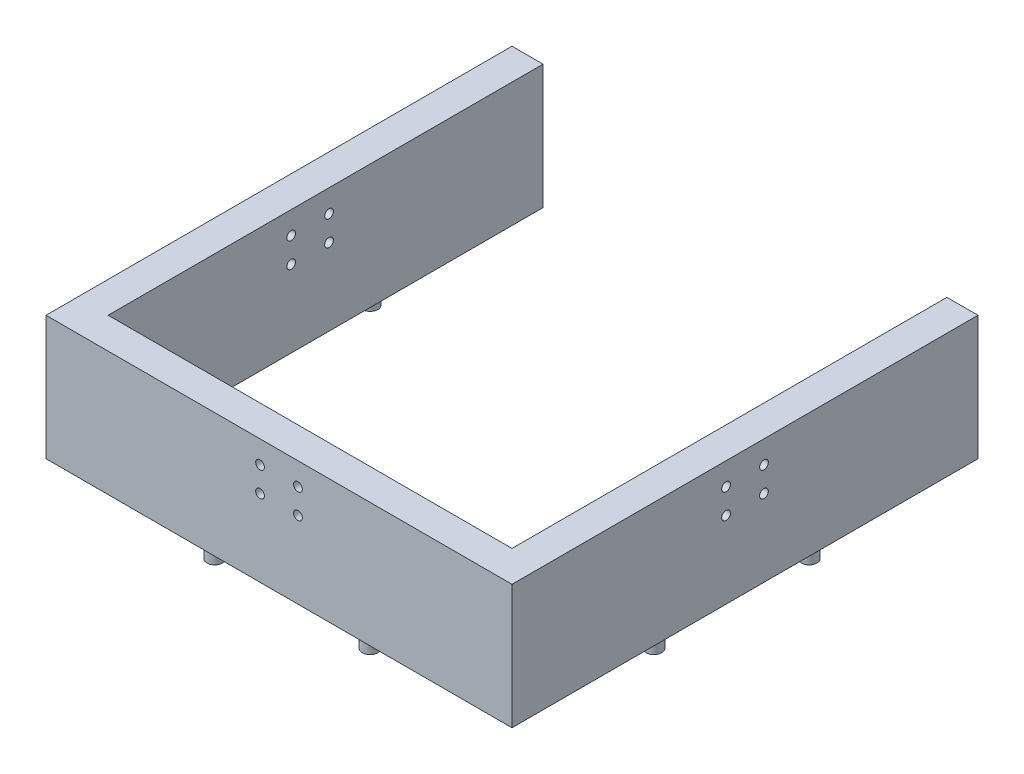
ISO-10303-21;
HEADER;
FILE_DESCRIPTION(('STEP AP214'),'2;1');
FILE_NAME('part.step','',(''),(''),'','','');
FILE_SCHEMA(('AUTOMOTIVE_DESIGN { 1 0 10303 214 1 1 1 1 }'));
ENDSEC;
DATA;
#1=APPLICATION_CONTEXT('core data for automotive mechanical design processes');
#2=APPLICATION_PROTOCOL_DEFINITION('international standard','automotive_design',2000,#1);
#3=PRODUCT_CONTEXT('',#1,'mechanical');
#4=PRODUCT('Part','Part','',(#3));
#5=PRODUCT_RELATED_PRODUCT_CATEGORY('part','',(#4));
#6=PRODUCT_DEFINITION_FORMATION('','',#4);
#7=PRODUCT_DEFINITION_CONTEXT('part definition',#1,'design');
#8=PRODUCT_DEFINITION('design','',#6,#7);
#9=PRODUCT_DEFINITION_SHAPE('','',#8);
#10=(LENGTH_UNIT() NAMED_UNIT(*) SI_UNIT(.MILLI.,.METRE.));
#11=(NAMED_UNIT(*) PLANE_ANGLE_UNIT() SI_UNIT($,.RADIAN.));
#12=(NAMED_UNIT(*) SI_UNIT($,.STERADIAN.) SOLID_ANGLE_UNIT());
#13=UNCERTAINTY_MEASURE_WITH_UNIT(LENGTH_MEASURE(1.E-05),#10,'distance_accuracy_value','');
#14=(GEOMETRIC_REPRESENTATION_CONTEXT(3) GLOBAL_UNCERTAINTY_ASSIGNED_CONTEXT((#13)) GLOBAL_UNIT_ASSIGNED_CONTEXT((#10,
#11,#12)) REPRESENTATION_CONTEXT('',''));
#15=CARTESIAN_POINT('',(0.,0.,0.));
#16=DIRECTION('',(0.,0.,1.));
#17=DIRECTION('',(1.,0.,0.));
#18=AXIS2_PLACEMENT_3D('',#15,#16,#17);
#19=CARTESIAN_POINT('',(-75.,-40.,-75.));
#20=DIRECTION('',(0.,0.,-1.));
#21=DIRECTION('',(-1.,0.,0.));
#22=AXIS2_PLACEMENT_3D('',#19,#20,#21);
#23=PLANE('',#22);
#24=DIRECTION('',(0.,1.,0.));
#25=VECTOR('',#24,1.);
#26=CARTESIAN_POINT('',(-65.,-40.,-75.));
#27=LINE('',#26,#25);
#28=CARTESIAN_POINT('',(-65.,-40.,-75.));
#29=VERTEX_POINT('',#28);
#30=CARTESIAN_POINT('',(-65.,0.,-75.));
#31=VERTEX_POINT('',#30);
#32=EDGE_CURVE('E130',#29,#31,#27,.T.);
#33=ORIENTED_EDGE('',*,*,#32,.F.);
#34=DIRECTION('',(-1.,0.,0.));
#35=VECTOR('',#34,1.);
#36=CARTESIAN_POINT('',(-75.,-40.,-75.));
#37=LINE('',#36,#35);
#38=CARTESIAN_POINT('',(-75.,-40.,-75.));
#39=VERTEX_POINT('',#38);
#40=EDGE_CURVE('E176',#29,#39,#37,.T.);
#41=ORIENTED_EDGE('',*,*,#40,.T.);
#42=DIRECTION('',(0.,1.,0.));
#43=VECTOR('',#42,1.);
#44=CARTESIAN_POINT('',(-75.,-40.,-75.));
#45=LINE('',#44,#43);
#46=CARTESIAN_POINT('',(-75.,0.,-75.));
#47=VERTEX_POINT('',#46);
#48=EDGE_CURVE('E142',#39,#47,#45,.T.);
#49=ORIENTED_EDGE('',*,*,#48,.T.);
#50=DIRECTION('',(-1.,0.,0.));
#51=VECTOR('',#50,1.);
#52=CARTESIAN_POINT('',(-75.,0.,-75.));
#53=LINE('',#52,#51);
#54=EDGE_CURVE('E119',#31,#47,#53,.T.);
#55=ORIENTED_EDGE('',*,*,#54,.F.);
#56=EDGE_LOOP('',(#33,#41,#49,#55));
#57=FACE_BOUND('',#56,.T.);
#58=ADVANCED_FACE('F41',(#57),#23,.T.);
#59=CARTESIAN_POINT('',(75.,-40.,75.));
#60=DIRECTION('',(1.,0.,0.));
#61=DIRECTION('',(0.,0.,-1.));
#62=AXIS2_PLACEMENT_3D('',#59,#60,#61);
#63=PLANE('',#62);
#64=CARTESIAN_POINT('',(75.,-7.24999999999999,-6.1));
#65=DIRECTION('',(-1.,0.,0.));
#66=DIRECTION('',(0.,0.,1.));
#67=AXIS2_PLACEMENT_3D('',#64,#65,#66);
#68=CIRCLE('',#67,1.4);
#69=CARTESIAN_POINT('',(75.,-7.24999999999999,-4.7));
#70=VERTEX_POINT('',#69);
#71=EDGE_CURVE('E332',#70,#70,#68,.T.);
#72=ORIENTED_EDGE('',*,*,#71,.T.);
#73=EDGE_LOOP('',(#72));
#74=FACE_BOUND('',#73,.T.);
#75=CARTESIAN_POINT('',(75.,-15.25,6.1));
#76=DIRECTION('',(-1.,0.,0.));
#77=DIRECTION('',(0.,0.,1.));
#78=AXIS2_PLACEMENT_3D('',#75,#76,#77);
#79=CIRCLE('',#78,1.4);
#80=CARTESIAN_POINT('',(75.,-15.25,7.5));
#81=VERTEX_POINT('',#80);
#82=EDGE_CURVE('E138',#81,#81,#79,.T.);
#83=ORIENTED_EDGE('',*,*,#82,.T.);
#84=EDGE_LOOP('',(#83));
#85=FACE_BOUND('',#84,.T.);
#86=DIRECTION('',(0.,0.,-1.));
#87=VECTOR('',#86,1.);
#88=CARTESIAN_POINT('',(75.,0.,75.));
#89=LINE('',#88,#87);
#90=CARTESIAN_POINT('',(75.,0.,75.));
#91=VERTEX_POINT('',#90);
#92=CARTESIAN_POINT('',(75.,0.,-75.));
#93=VERTEX_POINT('',#92);
#94=EDGE_CURVE('E145',#91,#93,#89,.T.);
#95=ORIENTED_EDGE('',*,*,#94,.F.);
#96=DIRECTION('',(0.,1.,0.));
#97=VECTOR('',#96,1.);
#98=CARTESIAN_POINT('',(75.,-40.,75.));
#99=LINE('',#98,#97);
#100=CARTESIAN_POINT('',(75.,-40.,75.));
#101=VERTEX_POINT('',#100);
#102=EDGE_CURVE('E11',#101,#91,#99,.T.);
#103=ORIENTED_EDGE('',*,*,#102,.F.);
#104=DIRECTION('',(0.,0.,-1.));
#105=VECTOR('',#104,1.);
#106=CARTESIAN_POINT('',(75.,-40.,75.));
#107=LINE('',#106,#105);
#108=CARTESIAN_POINT('',(75.,-40.,-75.));
#109=VERTEX_POINT('',#108);
#110=EDGE_CURVE('E161',#101,#109,#107,.T.);
#111=ORIENTED_EDGE('',*,*,#110,.T.);
#112=DIRECTION('',(0.,1.,0.));
#113=VECTOR('',#112,1.);
#114=CARTESIAN_POINT('',(75.,-40.,-75.));
#115=LINE('',#114,#113);
#116=EDGE_CURVE('E45',#109,#93,#115,.T.);
#117=ORIENTED_EDGE('',*,*,#116,.T.);
#118=EDGE_LOOP('',(#95,#103,#111,#117));
#119=FACE_BOUND('',#118,.T.);
#120=CARTESIAN_POINT('',(75.,-15.25,-6.1));
#121=DIRECTION('',(1.,0.,0.));
#122=DIRECTION('',(0.,0.,-1.));
#123=AXIS2_PLACEMENT_3D('',#120,#121,#122);
#124=CIRCLE('',#123,1.4);
#125=CARTESIAN_POINT('',(75.,-15.25,-7.5));
#126=VERTEX_POINT('',#125);
#127=EDGE_CURVE('E324',#126,#126,#124,.T.);
#128=ORIENTED_EDGE('',*,*,#127,.F.);
#129=EDGE_LOOP('',(#128));
#130=FACE_BOUND('',#129,.T.);
#131=CARTESIAN_POINT('',(75.,-7.25,6.1));
#132=DIRECTION('',(1.,0.,0.));
#133=DIRECTION('',(0.,0.,-1.));
#134=AXIS2_PLACEMENT_3D('',#131,#132,#133);
#135=CIRCLE('',#134,1.4);
#136=CARTESIAN_POINT('',(75.,-7.25,4.7));
#137=VERTEX_POINT('',#136);
#138=EDGE_CURVE('E301',#137,#137,#135,.T.);
#139=ORIENTED_EDGE('',*,*,#138,.F.);
#140=EDGE_LOOP('',(#139));
#141=FACE_BOUND('',#140,.T.);
#142=ADVANCED_FACE('F43',(#74,#85,#119,#130,#141),#63,.T.);
#143=CARTESIAN_POINT('',(-75.,-40.,75.));
#144=DIRECTION('',(0.,0.,1.));
#145=DIRECTION('',(1.,0.,0.));
#146=AXIS2_PLACEMENT_3D('',#143,#144,#145);
#147=PLANE('',#146);
#148=CARTESIAN_POINT('',(6.10000000000026,-7.24999999999999,75.));
#149=DIRECTION('',(0.,0.,-1.));
#150=DIRECTION('',(-1.,0.,0.));
#151=AXIS2_PLACEMENT_3D('',#148,#149,#150);
#152=CIRCLE('',#151,1.4);
#153=CARTESIAN_POINT('',(4.70000000000026,-7.24999999999999,75.));
#154=VERTEX_POINT('',#153);
#155=EDGE_CURVE('E294',#154,#154,#152,.T.);
#156=ORIENTED_EDGE('',*,*,#155,.T.);
#157=EDGE_LOOP('',(#156));
#158=FACE_BOUND('',#157,.T.);
#159=CARTESIAN_POINT('',(-6.09999999999974,-7.25,75.));
#160=DIRECTION('',(0.,0.,1.));
#161=DIRECTION('',(1.,0.,0.));
#162=AXIS2_PLACEMENT_3D('',#159,#160,#161);
#163=CIRCLE('',#162,1.4);
#164=CARTESIAN_POINT('',(-4.69999999999974,-7.25,75.));
#165=VERTEX_POINT('',#164);
#166=EDGE_CURVE('E277',#165,#165,#163,.T.);
#167=ORIENTED_EDGE('',*,*,#166,.F.);
#168=EDGE_LOOP('',(#167));
#169=FACE_BOUND('',#168,.T.);
#170=DIRECTION('',(1.,0.,0.));
#171=VECTOR('',#170,1.);
#172=CARTESIAN_POINT('',(-75.,0.,75.));
#173=LINE('',#172,#171);
#174=CARTESIAN_POINT('',(-75.,0.,75.));
#175=VERTEX_POINT('',#174);
#176=EDGE_CURVE('E158',#175,#91,#173,.T.);
#177=ORIENTED_EDGE('',*,*,#176,.F.);
#178=DIRECTION('',(0.,1.,0.));
#179=VECTOR('',#178,1.);
#180=CARTESIAN_POINT('',(-75.,-40.,75.));
#181=LINE('',#180,#179);
#182=CARTESIAN_POINT('',(-75.,-40.,75.));
#183=VERTEX_POINT('',#182);
#184=EDGE_CURVE('E52',#183,#175,#181,.T.);
#185=ORIENTED_EDGE('',*,*,#184,.F.);
#186=DIRECTION('',(1.,0.,0.));
#187=VECTOR('',#186,1.);
#188=CARTESIAN_POINT('',(-75.,-40.,75.));
#189=LINE('',#188,#187);
#190=EDGE_CURVE('E166',#183,#101,#189,.T.);
#191=ORIENTED_EDGE('',*,*,#190,.T.);
#192=ORIENTED_EDGE('',*,*,#102,.T.);
#193=EDGE_LOOP('',(#177,#185,#191,#192));
#194=FACE_BOUND('',#193,.T.);
#195=CARTESIAN_POINT('',(6.10000000000026,-15.25,75.));
#196=DIRECTION('',(0.,0.,1.));
#197=DIRECTION('',(1.,0.,0.));
#198=AXIS2_PLACEMENT_3D('',#195,#196,#197);
#199=CIRCLE('',#198,1.4);
#200=CARTESIAN_POINT('',(7.50000000000026,-15.25,75.));
#201=VERTEX_POINT('',#200);
#202=EDGE_CURVE('E285',#201,#201,#199,.T.);
#203=ORIENTED_EDGE('',*,*,#202,.F.);
#204=EDGE_LOOP('',(#203));
#205=FACE_BOUND('',#204,.T.);
#206=CARTESIAN_POINT('',(-6.09999999999973,-15.25,75.));
#207=DIRECTION('',(0.,0.,-1.));
#208=DIRECTION('',(-1.,0.,0.));
#209=AXIS2_PLACEMENT_3D('',#206,#207,#208);
#210=CIRCLE('',#209,1.4);
#211=CARTESIAN_POINT('',(-7.49999999999973,-15.25,75.));
#212=VERTEX_POINT('',#211);
#213=EDGE_CURVE('E310',#212,#212,#210,.T.);
#214=ORIENTED_EDGE('',*,*,#213,.T.);
#215=EDGE_LOOP('',(#214));
#216=FACE_BOUND('',#215,.T.);
#217=ADVANCED_FACE('F353',(#158,#169,#194,#205,#216),#147,.T.);
#218=CARTESIAN_POINT('',(65.,-54.,65.));
#219=DIRECTION('',(1.,0.,0.));
#220=DIRECTION('',(0.,0.,-1.));
#221=AXIS2_PLACEMENT_3D('',#218,#219,#220);
#222=PLANE('',#221);
#223=CARTESIAN_POINT('',(65.,-15.25,-6.1));
#224=DIRECTION('',(1.,0.,0.));
#225=DIRECTION('',(0.,0.,-1.));
#226=AXIS2_PLACEMENT_3D('',#223,#224,#225);
#227=CIRCLE('',#226,1.4);
#228=CARTESIAN_POINT('',(65.,-15.25,-7.5));
#229=VERTEX_POINT('',#228);
#230=EDGE_CURVE('E328',#229,#229,#227,.T.);
#231=ORIENTED_EDGE('',*,*,#230,.T.);
#232=EDGE_LOOP('',(#231));
#233=FACE_BOUND('',#232,.T.);
#234=CARTESIAN_POINT('',(65.,-15.25,6.1));
#235=DIRECTION('',(-1.,0.,0.));
#236=DIRECTION('',(0.,0.,1.));
#237=AXIS2_PLACEMENT_3D('',#234,#235,#236);
#238=CIRCLE('',#237,1.4);
#239=CARTESIAN_POINT('',(65.,-15.25,7.5));
#240=VERTEX_POINT('',#239);
#241=EDGE_CURVE('E320',#240,#240,#238,.T.);
#242=ORIENTED_EDGE('',*,*,#241,.F.);
#243=EDGE_LOOP('',(#242));
#244=FACE_BOUND('',#243,.T.);
#245=DIRECTION('',(0.,0.,1.));
#246=VECTOR('',#245,1.);
#247=CARTESIAN_POINT('',(65.,-40.,0.));
#248=LINE('',#247,#246);
#249=CARTESIAN_POINT('',(65.,-40.,-75.));
#250=VERTEX_POINT('',#249);
#251=CARTESIAN_POINT('',(65.,-40.,65.));
#252=VERTEX_POINT('',#251);
#253=EDGE_CURVE('E152',#250,#252,#248,.T.);
#254=ORIENTED_EDGE('',*,*,#253,.T.);
#255=DIRECTION('',(0.,1.,0.));
#256=VECTOR('',#255,1.);
#257=CARTESIAN_POINT('',(65.,-54.,65.));
#258=LINE('',#257,#256);
#259=CARTESIAN_POINT('',(65.,0.,65.));
#260=VERTEX_POINT('',#259);
#261=EDGE_CURVE('E186',#252,#260,#258,.T.);
#262=ORIENTED_EDGE('',*,*,#261,.T.);
#263=DIRECTION('',(0.,0.,-1.));
#264=VECTOR('',#263,1.);
#265=CARTESIAN_POINT('',(65.,0.,65.));
#266=LINE('',#265,#264);
#267=CARTESIAN_POINT('',(65.,0.,-75.));
#268=VERTEX_POINT('',#267);
#269=EDGE_CURVE('E127',#260,#268,#266,.T.);
#270=ORIENTED_EDGE('',*,*,#269,.T.);
#271=DIRECTION('',(0.,-1.,0.));
#272=VECTOR('',#271,1.);
#273=CARTESIAN_POINT('',(65.,-40.,-75.));
#274=LINE('',#273,#272);
#275=EDGE_CURVE('E139',#268,#250,#274,.T.);
#276=ORIENTED_EDGE('',*,*,#275,.T.);
#277=EDGE_LOOP('',(#254,#262,#270,#276));
#278=FACE_BOUND('',#277,.T.);
#279=CARTESIAN_POINT('',(65.,-7.24999999999999,-6.1));
#280=DIRECTION('',(-1.,0.,0.));
#281=DIRECTION('',(0.,0.,1.));
#282=AXIS2_PLACEMENT_3D('',#279,#280,#281);
#283=CIRCLE('',#282,1.4);
#284=CARTESIAN_POINT('',(65.,-7.24999999999999,-4.7));
#285=VERTEX_POINT('',#284);
#286=EDGE_CURVE('E306',#285,#285,#283,.T.);
#287=ORIENTED_EDGE('',*,*,#286,.F.);
#288=EDGE_LOOP('',(#287));
#289=FACE_BOUND('',#288,.T.);
#290=CARTESIAN_POINT('',(65.,-7.25,6.1));
#291=DIRECTION('',(1.,0.,0.));
#292=DIRECTION('',(0.,0.,-1.));
#293=AXIS2_PLACEMENT_3D('',#290,#291,#292);
#294=CIRCLE('',#293,1.4);
#295=CARTESIAN_POINT('',(65.,-7.25,4.7));
#296=VERTEX_POINT('',#295);
#297=EDGE_CURVE('E305',#296,#296,#294,.T.);
#298=ORIENTED_EDGE('',*,*,#297,.T.);
#299=EDGE_LOOP('',(#298));
#300=FACE_BOUND('',#299,.T.);
#301=ADVANCED_FACE('F343',(#233,#244,#278,#289,#300),#222,.F.);
#302=CARTESIAN_POINT('',(-65.,-54.,65.));
#303=DIRECTION('',(0.,0.,1.));
#304=DIRECTION('',(1.,0.,0.));
#305=AXIS2_PLACEMENT_3D('',#302,#303,#304);
#306=PLANE('',#305);
#307=CARTESIAN_POINT('',(6.10000000000023,-15.25,65.));
#308=DIRECTION('',(0.,0.,1.));
#309=DIRECTION('',(1.,0.,0.));
#310=AXIS2_PLACEMENT_3D('',#307,#308,#309);
#311=CIRCLE('',#310,1.4);
#312=CARTESIAN_POINT('',(7.50000000000022,-15.25,65.));
#313=VERTEX_POINT('',#312);
#314=EDGE_CURVE('E289',#313,#313,#311,.T.);
#315=ORIENTED_EDGE('',*,*,#314,.T.);
#316=EDGE_LOOP('',(#315));
#317=FACE_BOUND('',#316,.T.);
#318=CARTESIAN_POINT('',(-6.09999999999977,-7.25,65.));
#319=DIRECTION('',(0.,0.,1.));
#320=DIRECTION('',(1.,0.,0.));
#321=AXIS2_PLACEMENT_3D('',#318,#319,#320);
#322=CIRCLE('',#321,1.4);
#323=CARTESIAN_POINT('',(-4.69999999999977,-7.25,65.));
#324=VERTEX_POINT('',#323);
#325=EDGE_CURVE('E258',#324,#324,#322,.T.);
#326=ORIENTED_EDGE('',*,*,#325,.T.);
#327=EDGE_LOOP('',(#326));
#328=FACE_BOUND('',#327,.T.);
#329=DIRECTION('',(-1.,0.,0.));
#330=VECTOR('',#329,1.);
#331=CARTESIAN_POINT('',(0.,-40.,65.));
#332=LINE('',#331,#330);
#333=CARTESIAN_POINT('',(-65.,-40.,65.));
#334=VERTEX_POINT('',#333);
#335=EDGE_CURVE('E181',#252,#334,#332,.T.);
#336=ORIENTED_EDGE('',*,*,#335,.T.);
#337=DIRECTION('',(0.,1.,0.));
#338=VECTOR('',#337,1.);
#339=CARTESIAN_POINT('',(-65.,-54.,65.));
#340=LINE('',#339,#338);
#341=CARTESIAN_POINT('',(-65.,0.,65.));
#342=VERTEX_POINT('',#341);
#343=EDGE_CURVE('E187',#334,#342,#340,.T.);
#344=ORIENTED_EDGE('',*,*,#343,.T.);
#345=DIRECTION('',(1.,0.,0.));
#346=VECTOR('',#345,1.);
#347=CARTESIAN_POINT('',(-65.,0.,65.));
#348=LINE('',#347,#346);
#349=EDGE_CURVE('E123',#342,#260,#348,.T.);
#350=ORIENTED_EDGE('',*,*,#349,.T.);
#351=ORIENTED_EDGE('',*,*,#261,.F.);
#352=EDGE_LOOP('',(#336,#344,#350,#351));
#353=FACE_BOUND('',#352,.T.);
#354=CARTESIAN_POINT('',(6.10000000000023,-7.24999999999999,65.));
#355=DIRECTION('',(0.,0.,-1.));
#356=DIRECTION('',(-1.,0.,0.));
#357=AXIS2_PLACEMENT_3D('',#354,#355,#356);
#358=CIRCLE('',#357,1.4);
#359=CARTESIAN_POINT('',(4.70000000000023,-7.24999999999999,65.));
#360=VERTEX_POINT('',#359);
#361=EDGE_CURVE('E281',#360,#360,#358,.T.);
#362=ORIENTED_EDGE('',*,*,#361,.F.);
#363=EDGE_LOOP('',(#362));
#364=FACE_BOUND('',#363,.T.);
#365=CARTESIAN_POINT('',(-6.09999999999977,-15.25,65.));
#366=DIRECTION('',(0.,0.,-1.));
#367=DIRECTION('',(-1.,0.,0.));
#368=AXIS2_PLACEMENT_3D('',#365,#366,#367);
#369=CIRCLE('',#368,1.4);
#370=CARTESIAN_POINT('',(-7.49999999999977,-15.25,65.));
#371=VERTEX_POINT('',#370);
#372=EDGE_CURVE('E290',#371,#371,#369,.T.);
#373=ORIENTED_EDGE('',*,*,#372,.F.);
#374=EDGE_LOOP('',(#373));
#375=FACE_BOUND('',#374,.T.);
#376=ADVANCED_FACE('F389',(#317,#328,#353,#364,#375),#306,.F.);
#377=CARTESIAN_POINT('',(-75.,-40.,75.));
#378=DIRECTION('',(-1.,0.,0.));
#379=DIRECTION('',(0.,0.,1.));
#380=AXIS2_PLACEMENT_3D('',#377,#378,#379);
#381=PLANE('',#380);
#382=CARTESIAN_POINT('',(-75.,-7.24999999999999,6.1));
#383=DIRECTION('',(1.,0.,0.));
#384=DIRECTION('',(0.,0.,-1.));
#385=AXIS2_PLACEMENT_3D('',#382,#383,#384);
#386=CIRCLE('',#385,1.4);
#387=CARTESIAN_POINT('',(-75.,-7.24999999999999,4.7));
#388=VERTEX_POINT('',#387);
#389=EDGE_CURVE('E249',#388,#388,#386,.T.);
#390=ORIENTED_EDGE('',*,*,#389,.T.);
#391=EDGE_LOOP('',(#390));
#392=FACE_BOUND('',#391,.T.);
#393=CARTESIAN_POINT('',(-75.,-7.25,-6.1));
#394=DIRECTION('',(-1.,0.,0.));
#395=DIRECTION('',(0.,0.,1.));
#396=AXIS2_PLACEMENT_3D('',#393,#394,#395);
#397=CIRCLE('',#396,1.4);
#398=CARTESIAN_POINT('',(-75.,-7.25,-4.7));
#399=VERTEX_POINT('',#398);
#400=EDGE_CURVE('E245',#399,#399,#397,.T.);
#401=ORIENTED_EDGE('',*,*,#400,.F.);
#402=EDGE_LOOP('',(#401));
#403=FACE_BOUND('',#402,.T.);
#404=DIRECTION('',(0.,0.,1.));
#405=VECTOR('',#404,1.);
#406=CARTESIAN_POINT('',(-75.,0.,75.));
#407=LINE('',#406,#405);
#408=EDGE_CURVE('E150',#47,#175,#407,.T.);
#409=ORIENTED_EDGE('',*,*,#408,.F.);
#410=ORIENTED_EDGE('',*,*,#48,.F.);
#411=DIRECTION('',(0.,0.,1.));
#412=VECTOR('',#411,1.);
#413=CARTESIAN_POINT('',(-75.,-40.,75.));
#414=LINE('',#413,#412);
#415=EDGE_CURVE('E168',#39,#183,#414,.T.);
#416=ORIENTED_EDGE('',*,*,#415,.T.);
#417=ORIENTED_EDGE('',*,*,#184,.T.);
#418=EDGE_LOOP('',(#409,#410,#416,#417));
#419=FACE_BOUND('',#418,.T.);
#420=CARTESIAN_POINT('',(-75.,-15.25,6.1));
#421=DIRECTION('',(-1.,0.,0.));
#422=DIRECTION('',(0.,0.,1.));
#423=AXIS2_PLACEMENT_3D('',#420,#421,#422);
#424=CIRCLE('',#423,1.4);
#425=CARTESIAN_POINT('',(-75.,-15.25,7.5));
#426=VERTEX_POINT('',#425);
#427=EDGE_CURVE('E266',#426,#426,#424,.T.);
#428=ORIENTED_EDGE('',*,*,#427,.F.);
#429=EDGE_LOOP('',(#428));
#430=FACE_BOUND('',#429,.T.);
#431=CARTESIAN_POINT('',(-75.,-15.25,-6.1));
#432=DIRECTION('',(1.,0.,0.));
#433=DIRECTION('',(0.,0.,-1.));
#434=AXIS2_PLACEMENT_3D('',#431,#432,#433);
#435=CIRCLE('',#434,1.4);
#436=CARTESIAN_POINT('',(-75.,-15.25,-7.5));
#437=VERTEX_POINT('',#436);
#438=EDGE_CURVE('E257',#437,#437,#435,.T.);
#439=ORIENTED_EDGE('',*,*,#438,.T.);
#440=EDGE_LOOP('',(#439));
#441=FACE_BOUND('',#440,.T.);
#442=ADVANCED_FACE('F383',(#392,#403,#419,#430,#441),#381,.T.);
#443=CARTESIAN_POINT('',(-65.,-54.,65.));
#444=DIRECTION('',(-1.,0.,0.));
#445=DIRECTION('',(0.,0.,1.));
#446=AXIS2_PLACEMENT_3D('',#443,#444,#445);
#447=PLANE('',#446);
#448=CARTESIAN_POINT('',(-65.,-15.25,6.1));
#449=DIRECTION('',(-1.,0.,0.));
#450=DIRECTION('',(0.,0.,1.));
#451=AXIS2_PLACEMENT_3D('',#448,#449,#450);
#452=CIRCLE('',#451,1.4);
#453=CARTESIAN_POINT('',(-65.,-15.25,7.5));
#454=VERTEX_POINT('',#453);
#455=EDGE_CURVE('E262',#454,#454,#452,.T.);
#456=ORIENTED_EDGE('',*,*,#455,.T.);
#457=EDGE_LOOP('',(#456));
#458=FACE_BOUND('',#457,.T.);
#459=CARTESIAN_POINT('',(-65.,-7.25,-6.1));
#460=DIRECTION('',(-1.,0.,0.));
#461=DIRECTION('',(0.,0.,1.));
#462=AXIS2_PLACEMENT_3D('',#459,#460,#461);
#463=CIRCLE('',#462,1.4);
#464=CARTESIAN_POINT('',(-65.,-7.25,-4.7));
#465=VERTEX_POINT('',#464);
#466=EDGE_CURVE('E241',#465,#465,#463,.T.);
#467=ORIENTED_EDGE('',*,*,#466,.T.);
#468=EDGE_LOOP('',(#467));
#469=FACE_BOUND('',#468,.T.);
#470=DIRECTION('',(0.,0.,-1.));
#471=VECTOR('',#470,1.);
#472=CARTESIAN_POINT('',(-65.,-40.,0.));
#473=LINE('',#472,#471);
#474=EDGE_CURVE('E134',#334,#29,#473,.T.);
#475=ORIENTED_EDGE('',*,*,#474,.T.);
#476=ORIENTED_EDGE('',*,*,#32,.T.);
#477=DIRECTION('',(0.,0.,1.));
#478=VECTOR('',#477,1.);
#479=CARTESIAN_POINT('',(-65.,0.,65.));
#480=LINE('',#479,#478);
#481=EDGE_CURVE('E115',#31,#342,#480,.T.);
#482=ORIENTED_EDGE('',*,*,#481,.T.);
#483=ORIENTED_EDGE('',*,*,#343,.F.);
#484=EDGE_LOOP('',(#475,#476,#482,#483));
#485=FACE_BOUND('',#484,.T.);
#486=CARTESIAN_POINT('',(-65.,-7.24999999999999,6.1));
#487=DIRECTION('',(1.,0.,0.));
#488=DIRECTION('',(0.,0.,-1.));
#489=AXIS2_PLACEMENT_3D('',#486,#487,#488);
#490=CIRCLE('',#489,1.4);
#491=CARTESIAN_POINT('',(-65.,-7.24999999999999,4.7));
#492=VERTEX_POINT('',#491);
#493=EDGE_CURVE('E270',#492,#492,#490,.T.);
#494=ORIENTED_EDGE('',*,*,#493,.F.);
#495=EDGE_LOOP('',(#494));
#496=FACE_BOUND('',#495,.T.);
#497=CARTESIAN_POINT('',(-65.,-15.25,-6.1));
#498=DIRECTION('',(1.,0.,0.));
#499=DIRECTION('',(0.,0.,-1.));
#500=AXIS2_PLACEMENT_3D('',#497,#498,#499);
#501=CIRCLE('',#500,1.4);
#502=CARTESIAN_POINT('',(-65.,-15.25,-7.5));
#503=VERTEX_POINT('',#502);
#504=EDGE_CURVE('E253',#503,#503,#501,.T.);
#505=ORIENTED_EDGE('',*,*,#504,.F.);
#506=EDGE_LOOP('',(#505));
#507=FACE_BOUND('',#506,.T.);
#508=ADVANCED_FACE('F131',(#458,#469,#485,#496,#507),#447,.F.);
#509=ORIENTED_EDGE('',*,*,#275,.F.);
#510=EDGE_CURVE('E144',#93,#268,#53,.T.);
#511=ORIENTED_EDGE('',*,*,#510,.F.);
#512=ORIENTED_EDGE('',*,*,#116,.F.);
#513=EDGE_CURVE('E171',#109,#250,#37,.T.);
#514=ORIENTED_EDGE('',*,*,#513,.T.);
#515=EDGE_LOOP('',(#509,#511,#512,#514));
#516=FACE_BOUND('',#515,.T.);
#517=ADVANCED_FACE('F346',(#516),#23,.T.);
#518=CARTESIAN_POINT('',(0.,-40.,0.));
#519=DIRECTION('',(0.,-1.,0.));
#520=DIRECTION('',(0.,0.,-1.));
#521=AXIS2_PLACEMENT_3D('',#518,#519,#520);
#522=PLANE('',#521);
#523=ORIENTED_EDGE('',*,*,#40,.F.);
#524=ORIENTED_EDGE('',*,*,#474,.F.);
#525=ORIENTED_EDGE('',*,*,#335,.F.);
#526=ORIENTED_EDGE('',*,*,#253,.F.);
#527=ORIENTED_EDGE('',*,*,#513,.F.);
#528=ORIENTED_EDGE('',*,*,#110,.F.);
#529=ORIENTED_EDGE('',*,*,#190,.F.);
#530=ORIENTED_EDGE('',*,*,#415,.F.);
#531=EDGE_LOOP('',(#523,#524,#525,#526,#527,#528,#529,#530));
#532=FACE_BOUND('',#531,.T.);
#533=CARTESIAN_POINT('',(70.6781878722481,-40.,-24.999999999996));
#534=DIRECTION('',(0.,-1.,0.));
#535=DIRECTION('',(0.,0.,-1.));
#536=AXIS2_PLACEMENT_3D('',#533,#534,#535);
#537=CIRCLE('',#536,2.50000000000292);
#538=CARTESIAN_POINT('',(70.6781878722481,-40.,-27.4999999999989));
#539=VERTEX_POINT('',#538);
#540=EDGE_CURVE('E237',#539,#539,#537,.T.);
#541=ORIENTED_EDGE('',*,*,#540,.F.);
#542=EDGE_LOOP('',(#541));
#543=FACE_BOUND('',#542,.T.);
#544=CARTESIAN_POINT('',(70.6781878722481,-40.,25.000000000004));
#545=DIRECTION('',(0.,-1.,0.));
#546=DIRECTION('',(0.,0.,-1.));
#547=AXIS2_PLACEMENT_3D('',#544,#545,#546);
#548=CIRCLE('',#547,2.50000000000259);
#549=CARTESIAN_POINT('',(70.6781878722481,-40.,22.5000000000014));
#550=VERTEX_POINT('',#549);
#551=EDGE_CURVE('E229',#550,#550,#548,.T.);
#552=ORIENTED_EDGE('',*,*,#551,.F.);
#553=EDGE_LOOP('',(#552));
#554=FACE_BOUND('',#553,.T.);
#555=CARTESIAN_POINT('',(24.9999999999987,-40.,70.6781878722494));
#556=DIRECTION('',(0.,-1.,0.));
#557=DIRECTION('',(0.,0.,-1.));
#558=AXIS2_PLACEMENT_3D('',#555,#556,#557);
#559=CIRCLE('',#558,2.50000000000313);
#560=CARTESIAN_POINT('',(24.9999999999987,-40.,68.1781878722463));
#561=VERTEX_POINT('',#560);
#562=EDGE_CURVE('E221',#561,#561,#559,.T.);
#563=ORIENTED_EDGE('',*,*,#562,.F.);
#564=EDGE_LOOP('',(#563));
#565=FACE_BOUND('',#564,.T.);
#566=CARTESIAN_POINT('',(-25.0000000000013,-40.,70.6781878722494));
#567=DIRECTION('',(0.,-1.,0.));
#568=DIRECTION('',(0.,0.,-1.));
#569=AXIS2_PLACEMENT_3D('',#566,#567,#568);
#570=CIRCLE('',#569,2.50000000000297);
#571=CARTESIAN_POINT('',(-25.0000000000013,-40.,68.1781878722464));
#572=VERTEX_POINT('',#571);
#573=EDGE_CURVE('E213',#572,#572,#570,.T.);
#574=ORIENTED_EDGE('',*,*,#573,.F.);
#575=EDGE_LOOP('',(#574));
#576=FACE_BOUND('',#575,.T.);
#577=CARTESIAN_POINT('',(-70.6781878722467,-40.,25.));
#578=DIRECTION('',(0.,-1.,0.));
#579=DIRECTION('',(0.,0.,-1.));
#580=AXIS2_PLACEMENT_3D('',#577,#578,#579);
#581=CIRCLE('',#580,2.5);
#582=CARTESIAN_POINT('',(-70.6781878722467,-40.,22.5));
#583=VERTEX_POINT('',#582);
#584=EDGE_CURVE('E205',#583,#583,#581,.T.);
#585=ORIENTED_EDGE('',*,*,#584,.F.);
#586=EDGE_LOOP('',(#585));
#587=FACE_BOUND('',#586,.T.);
#588=CARTESIAN_POINT('',(-70.6781878722467,-40.,-25.));
#589=DIRECTION('',(0.,-1.,0.));
#590=DIRECTION('',(0.,0.,-1.));
#591=AXIS2_PLACEMENT_3D('',#588,#589,#590);
#592=CIRCLE('',#591,2.5);
#593=CARTESIAN_POINT('',(-70.6781878722467,-40.,-27.5));
#594=VERTEX_POINT('',#593);
#595=EDGE_CURVE('E197',#594,#594,#592,.T.);
#596=ORIENTED_EDGE('',*,*,#595,.F.);
#597=EDGE_LOOP('',(#596));
#598=FACE_BOUND('',#597,.T.);
#599=ADVANCED_FACE('F348',(#532,#543,#554,#565,#576,#587,#598),#522,.T.);
#600=CARTESIAN_POINT('',(0.,0.,0.));
#601=DIRECTION('',(0.,-1.,0.));
#602=DIRECTION('',(0.,0.,-1.));
#603=AXIS2_PLACEMENT_3D('',#600,#601,#602);
#604=PLANE('',#603);
#605=ORIENTED_EDGE('',*,*,#481,.F.);
#606=ORIENTED_EDGE('',*,*,#54,.T.);
#607=ORIENTED_EDGE('',*,*,#408,.T.);
#608=ORIENTED_EDGE('',*,*,#176,.T.);
#609=ORIENTED_EDGE('',*,*,#94,.T.);
#610=ORIENTED_EDGE('',*,*,#510,.T.);
#611=ORIENTED_EDGE('',*,*,#269,.F.);
#612=ORIENTED_EDGE('',*,*,#349,.F.);
#613=EDGE_LOOP('',(#605,#606,#607,#608,#609,#610,#611,#612));
#614=FACE_BOUND('',#613,.T.);
#615=ADVANCED_FACE('F117',(#614),#604,.F.);
#616=CARTESIAN_POINT('',(-70.6781878722467,-45.,-25.));
#617=DIRECTION('',(0.,1.,0.));
#618=DIRECTION('',(0.,0.,1.));
#619=AXIS2_PLACEMENT_3D('',#616,#617,#618);
#620=CYLINDRICAL_SURFACE('',#619,2.5);
#621=CARTESIAN_POINT('',(-70.6781878722467,-45.,-25.));
#622=DIRECTION('',(0.,-1.,0.));
#623=DIRECTION('',(0.,0.,-1.));
#624=AXIS2_PLACEMENT_3D('',#621,#622,#623);
#625=CIRCLE('',#624,2.5);
#626=CARTESIAN_POINT('',(-70.6781878722467,-45.,-27.5));
#627=VERTEX_POINT('',#626);
#628=EDGE_CURVE('E196',#627,#627,#625,.T.);
#629=ORIENTED_EDGE('',*,*,#628,.F.);
#630=EDGE_LOOP('',(#629));
#631=FACE_BOUND('',#630,.T.);
#632=ORIENTED_EDGE('',*,*,#595,.T.);
#633=EDGE_LOOP('',(#632));
#634=FACE_BOUND('',#633,.T.);
#635=ADVANCED_FACE('F400',(#631,#634),#620,.T.);
#636=CARTESIAN_POINT('',(-70.6781878722467,-45.,-25.));
#637=DIRECTION('',(0.,-1.,0.));
#638=DIRECTION('',(0.,0.,-1.));
#639=AXIS2_PLACEMENT_3D('',#636,#637,#638);
#640=PLANE('',#639);
#641=ORIENTED_EDGE('',*,*,#628,.T.);
#642=EDGE_LOOP('',(#641));
#643=FACE_BOUND('',#642,.T.);
#644=ADVANCED_FACE('F491',(#643),#640,.T.);
#645=CARTESIAN_POINT('',(-70.6781878722467,-45.,25.));
#646=DIRECTION('',(0.,1.,0.));
#647=DIRECTION('',(0.,0.,1.));
#648=AXIS2_PLACEMENT_3D('',#645,#646,#647);
#649=CYLINDRICAL_SURFACE('',#648,2.5);
#650=CARTESIAN_POINT('',(-70.6781878722467,-45.,25.));
#651=DIRECTION('',(0.,-1.,0.));
#652=DIRECTION('',(0.,0.,-1.));
#653=AXIS2_PLACEMENT_3D('',#650,#651,#652);
#654=CIRCLE('',#653,2.5);
#655=CARTESIAN_POINT('',(-70.6781878722467,-45.,22.5));
#656=VERTEX_POINT('',#655);
#657=EDGE_CURVE('E201',#656,#656,#654,.T.);
#658=ORIENTED_EDGE('',*,*,#657,.F.);
#659=EDGE_LOOP('',(#658));
#660=FACE_BOUND('',#659,.T.);
#661=ORIENTED_EDGE('',*,*,#584,.T.);
#662=EDGE_LOOP('',(#661));
#663=FACE_BOUND('',#662,.T.);
#664=ADVANCED_FACE('F497',(#660,#663),#649,.T.);
#665=CARTESIAN_POINT('',(-70.6781878722467,-45.,25.));
#666=DIRECTION('',(0.,-1.,0.));
#667=DIRECTION('',(0.,0.,-1.));
#668=AXIS2_PLACEMENT_3D('',#665,#666,#667);
#669=PLANE('',#668);
#670=ORIENTED_EDGE('',*,*,#657,.T.);
#671=EDGE_LOOP('',(#670));
#672=FACE_BOUND('',#671,.T.);
#673=ADVANCED_FACE('F505',(#672),#669,.T.);
#674=CARTESIAN_POINT('',(-25.0000000000013,-45.,70.6781878722494));
#675=DIRECTION('',(0.,1.,0.));
#676=DIRECTION('',(0.,0.,1.));
#677=AXIS2_PLACEMENT_3D('',#674,#675,#676);
#678=CYLINDRICAL_SURFACE('',#677,2.50000000000297);
#679=CARTESIAN_POINT('',(-25.0000000000013,-45.,70.6781878722494));
#680=DIRECTION('',(0.,-1.,0.));
#681=DIRECTION('',(0.,0.,-1.));
#682=AXIS2_PLACEMENT_3D('',#679,#680,#681);
#683=CIRCLE('',#682,2.50000000000297);
#684=CARTESIAN_POINT('',(-25.0000000000013,-45.,68.1781878722464));
#685=VERTEX_POINT('',#684);
#686=EDGE_CURVE('E209',#685,#685,#683,.T.);
#687=ORIENTED_EDGE('',*,*,#686,.F.);
#688=EDGE_LOOP('',(#687));
#689=FACE_BOUND('',#688,.T.);
#690=ORIENTED_EDGE('',*,*,#573,.T.);
#691=EDGE_LOOP('',(#690));
#692=FACE_BOUND('',#691,.T.);
#693=ADVANCED_FACE('F513',(#689,#692),#678,.T.);
#694=CARTESIAN_POINT('',(-25.0000000000013,-45.,70.6781878722494));
#695=DIRECTION('',(0.,-1.,0.));
#696=DIRECTION('',(0.,0.,-1.));
#697=AXIS2_PLACEMENT_3D('',#694,#695,#696);
#698=PLANE('',#697);
#699=ORIENTED_EDGE('',*,*,#686,.T.);
#700=EDGE_LOOP('',(#699));
#701=FACE_BOUND('',#700,.T.);
#702=ADVANCED_FACE('F521',(#701),#698,.T.);
#703=CARTESIAN_POINT('',(24.9999999999987,-45.,70.6781878722494));
#704=DIRECTION('',(0.,1.,0.));
#705=DIRECTION('',(0.,0.,1.));
#706=AXIS2_PLACEMENT_3D('',#703,#704,#705);
#707=CYLINDRICAL_SURFACE('',#706,2.50000000000313);
#708=CARTESIAN_POINT('',(24.9999999999987,-45.,70.6781878722494));
#709=DIRECTION('',(0.,-1.,0.));
#710=DIRECTION('',(0.,0.,-1.));
#711=AXIS2_PLACEMENT_3D('',#708,#709,#710);
#712=CIRCLE('',#711,2.50000000000313);
#713=CARTESIAN_POINT('',(24.9999999999987,-45.,68.1781878722463));
#714=VERTEX_POINT('',#713);
#715=EDGE_CURVE('E217',#714,#714,#712,.T.);
#716=ORIENTED_EDGE('',*,*,#715,.F.);
#717=EDGE_LOOP('',(#716));
#718=FACE_BOUND('',#717,.T.);
#719=ORIENTED_EDGE('',*,*,#562,.T.);
#720=EDGE_LOOP('',(#719));
#721=FACE_BOUND('',#720,.T.);
#722=ADVANCED_FACE('F529',(#718,#721),#707,.T.);
#723=CARTESIAN_POINT('',(24.9999999999987,-45.,70.6781878722494));
#724=DIRECTION('',(0.,-1.,0.));
#725=DIRECTION('',(0.,0.,-1.));
#726=AXIS2_PLACEMENT_3D('',#723,#724,#725);
#727=PLANE('',#726);
#728=ORIENTED_EDGE('',*,*,#715,.T.);
#729=EDGE_LOOP('',(#728));
#730=FACE_BOUND('',#729,.T.);
#731=ADVANCED_FACE('F537',(#730),#727,.T.);
#732=CARTESIAN_POINT('',(70.6781878722481,-45.,25.000000000004));
#733=DIRECTION('',(0.,1.,0.));
#734=DIRECTION('',(0.,0.,1.));
#735=AXIS2_PLACEMENT_3D('',#732,#733,#734);
#736=CYLINDRICAL_SURFACE('',#735,2.50000000000259);
#737=CARTESIAN_POINT('',(70.6781878722481,-45.,25.000000000004));
#738=DIRECTION('',(0.,-1.,0.));
#739=DIRECTION('',(0.,0.,-1.));
#740=AXIS2_PLACEMENT_3D('',#737,#738,#739);
#741=CIRCLE('',#740,2.50000000000259);
#742=CARTESIAN_POINT('',(70.6781878722481,-45.,22.5000000000014));
#743=VERTEX_POINT('',#742);
#744=EDGE_CURVE('E225',#743,#743,#741,.T.);
#745=ORIENTED_EDGE('',*,*,#744,.F.);
#746=EDGE_LOOP('',(#745));
#747=FACE_BOUND('',#746,.T.);
#748=ORIENTED_EDGE('',*,*,#551,.T.);
#749=EDGE_LOOP('',(#748));
#750=FACE_BOUND('',#749,.T.);
#751=ADVANCED_FACE('F545',(#747,#750),#736,.T.);
#752=CARTESIAN_POINT('',(70.6781878722481,-45.,25.000000000004));
#753=DIRECTION('',(0.,-1.,0.));
#754=DIRECTION('',(0.,0.,-1.));
#755=AXIS2_PLACEMENT_3D('',#752,#753,#754);
#756=PLANE('',#755);
#757=ORIENTED_EDGE('',*,*,#744,.T.);
#758=EDGE_LOOP('',(#757));
#759=FACE_BOUND('',#758,.T.);
#760=ADVANCED_FACE('F553',(#759),#756,.T.);
#761=CARTESIAN_POINT('',(70.6781878722481,-45.,-24.999999999996));
#762=DIRECTION('',(0.,1.,0.));
#763=DIRECTION('',(0.,0.,1.));
#764=AXIS2_PLACEMENT_3D('',#761,#762,#763);
#765=CYLINDRICAL_SURFACE('',#764,2.50000000000292);
#766=CARTESIAN_POINT('',(70.6781878722481,-45.,-24.999999999996));
#767=DIRECTION('',(0.,-1.,0.));
#768=DIRECTION('',(0.,0.,-1.));
#769=AXIS2_PLACEMENT_3D('',#766,#767,#768);
#770=CIRCLE('',#769,2.50000000000292);
#771=CARTESIAN_POINT('',(70.6781878722481,-45.,-27.4999999999989));
#772=VERTEX_POINT('',#771);
#773=EDGE_CURVE('E233',#772,#772,#770,.T.);
#774=ORIENTED_EDGE('',*,*,#773,.F.);
#775=EDGE_LOOP('',(#774));
#776=FACE_BOUND('',#775,.T.);
#777=ORIENTED_EDGE('',*,*,#540,.T.);
#778=EDGE_LOOP('',(#777));
#779=FACE_BOUND('',#778,.T.);
#780=ADVANCED_FACE('F561',(#776,#779),#765,.T.);
#781=CARTESIAN_POINT('',(70.6781878722481,-45.,-24.999999999996));
#782=DIRECTION('',(0.,-1.,0.));
#783=DIRECTION('',(0.,0.,-1.));
#784=AXIS2_PLACEMENT_3D('',#781,#782,#783);
#785=PLANE('',#784);
#786=ORIENTED_EDGE('',*,*,#773,.T.);
#787=EDGE_LOOP('',(#786));
#788=FACE_BOUND('',#787,.T.);
#789=ADVANCED_FACE('F569',(#788),#785,.T.);
#790=CARTESIAN_POINT('',(-65.,-7.25,-6.1));
#791=DIRECTION('',(-1.,0.,0.));
#792=DIRECTION('',(0.,0.,1.));
#793=AXIS2_PLACEMENT_3D('',#790,#791,#792);
#794=CYLINDRICAL_SURFACE('',#793,1.4);
#795=ORIENTED_EDGE('',*,*,#466,.F.);
#796=EDGE_LOOP('',(#795));
#797=FACE_BOUND('',#796,.T.);
#798=ORIENTED_EDGE('',*,*,#400,.T.);
#799=EDGE_LOOP('',(#798));
#800=FACE_BOUND('',#799,.T.);
#801=ADVANCED_FACE('F577',(#797,#800),#794,.F.);
#802=CARTESIAN_POINT('',(-65.,-7.24999999999999,6.1));
#803=DIRECTION('',(-1.,0.,0.));
#804=DIRECTION('',(0.,0.,1.));
#805=AXIS2_PLACEMENT_3D('',#802,#803,#804);
#806=CYLINDRICAL_SURFACE('',#805,1.4);
#807=ORIENTED_EDGE('',*,*,#493,.T.);
#808=EDGE_LOOP('',(#807));
#809=FACE_BOUND('',#808,.T.);
#810=ORIENTED_EDGE('',*,*,#389,.F.);
#811=EDGE_LOOP('',(#810));
#812=FACE_BOUND('',#811,.T.);
#813=ADVANCED_FACE('F586',(#809,#812),#806,.F.);
#814=CARTESIAN_POINT('',(-65.,-15.25,6.1));
#815=DIRECTION('',(-1.,0.,0.));
#816=DIRECTION('',(0.,0.,1.));
#817=AXIS2_PLACEMENT_3D('',#814,#815,#816);
#818=CYLINDRICAL_SURFACE('',#817,1.4);
#819=ORIENTED_EDGE('',*,*,#455,.F.);
#820=EDGE_LOOP('',(#819));
#821=FACE_BOUND('',#820,.T.);
#822=ORIENTED_EDGE('',*,*,#427,.T.);
#823=EDGE_LOOP('',(#822));
#824=FACE_BOUND('',#823,.T.);
#825=ADVANCED_FACE('F594',(#821,#824),#818,.F.);
#826=CARTESIAN_POINT('',(-65.,-15.25,-6.1));
#827=DIRECTION('',(-1.,0.,0.));
#828=DIRECTION('',(0.,0.,1.));
#829=AXIS2_PLACEMENT_3D('',#826,#827,#828);
#830=CYLINDRICAL_SURFACE('',#829,1.4);
#831=ORIENTED_EDGE('',*,*,#504,.T.);
#832=EDGE_LOOP('',(#831));
#833=FACE_BOUND('',#832,.T.);
#834=ORIENTED_EDGE('',*,*,#438,.F.);
#835=EDGE_LOOP('',(#834));
#836=FACE_BOUND('',#835,.T.);
#837=ADVANCED_FACE('F602',(#833,#836),#830,.F.);
#838=CARTESIAN_POINT('',(-6.09999999999977,-7.25,65.));
#839=DIRECTION('',(0.,0.,1.));
#840=DIRECTION('',(1.,0.,0.));
#841=AXIS2_PLACEMENT_3D('',#838,#839,#840);
#842=CYLINDRICAL_SURFACE('',#841,1.4);
#843=ORIENTED_EDGE('',*,*,#325,.F.);
#844=EDGE_LOOP('',(#843));
#845=FACE_BOUND('',#844,.T.);
#846=ORIENTED_EDGE('',*,*,#166,.T.);
#847=EDGE_LOOP('',(#846));
#848=FACE_BOUND('',#847,.T.);
#849=ADVANCED_FACE('F610',(#845,#848),#842,.F.);
#850=CARTESIAN_POINT('',(6.10000000000023,-7.24999999999999,65.));
#851=DIRECTION('',(0.,0.,1.));
#852=DIRECTION('',(1.,0.,0.));
#853=AXIS2_PLACEMENT_3D('',#850,#851,#852);
#854=CYLINDRICAL_SURFACE('',#853,1.4);
#855=ORIENTED_EDGE('',*,*,#361,.T.);
#856=EDGE_LOOP('',(#855));
#857=FACE_BOUND('',#856,.T.);
#858=ORIENTED_EDGE('',*,*,#155,.F.);
#859=EDGE_LOOP('',(#858));
#860=FACE_BOUND('',#859,.T.);
#861=ADVANCED_FACE('F424',(#857,#860),#854,.F.);
#862=CARTESIAN_POINT('',(6.10000000000023,-15.25,65.));
#863=DIRECTION('',(0.,0.,1.));
#864=DIRECTION('',(1.,0.,0.));
#865=AXIS2_PLACEMENT_3D('',#862,#863,#864);
#866=CYLINDRICAL_SURFACE('',#865,1.4);
#867=ORIENTED_EDGE('',*,*,#314,.F.);
#868=EDGE_LOOP('',(#867));
#869=FACE_BOUND('',#868,.T.);
#870=ORIENTED_EDGE('',*,*,#202,.T.);
#871=EDGE_LOOP('',(#870));
#872=FACE_BOUND('',#871,.T.);
#873=ADVANCED_FACE('F416',(#869,#872),#866,.F.);
#874=CARTESIAN_POINT('',(-6.09999999999977,-15.25,65.));
#875=DIRECTION('',(0.,0.,1.));
#876=DIRECTION('',(1.,0.,0.));
#877=AXIS2_PLACEMENT_3D('',#874,#875,#876);
#878=CYLINDRICAL_SURFACE('',#877,1.4);
#879=ORIENTED_EDGE('',*,*,#372,.T.);
#880=EDGE_LOOP('',(#879));
#881=FACE_BOUND('',#880,.T.);
#882=ORIENTED_EDGE('',*,*,#213,.F.);
#883=EDGE_LOOP('',(#882));
#884=FACE_BOUND('',#883,.T.);
#885=ADVANCED_FACE('F413',(#881,#884),#878,.F.);
#886=CARTESIAN_POINT('',(65.,-15.25,6.1));
#887=DIRECTION('',(1.,0.,0.));
#888=DIRECTION('',(0.,0.,-1.));
#889=AXIS2_PLACEMENT_3D('',#886,#887,#888);
#890=CYLINDRICAL_SURFACE('',#889,1.4);
#891=ORIENTED_EDGE('',*,*,#241,.T.);
#892=EDGE_LOOP('',(#891));
#893=FACE_BOUND('',#892,.T.);
#894=ORIENTED_EDGE('',*,*,#82,.F.);
#895=EDGE_LOOP('',(#894));
#896=FACE_BOUND('',#895,.T.);
#897=ADVANCED_FACE('F415',(#893,#896),#890,.F.);
#898=CARTESIAN_POINT('',(65.,-15.25,-6.1));
#899=DIRECTION('',(1.,0.,0.));
#900=DIRECTION('',(0.,0.,-1.));
#901=AXIS2_PLACEMENT_3D('',#898,#899,#900);
#902=CYLINDRICAL_SURFACE('',#901,1.4);
#903=ORIENTED_EDGE('',*,*,#230,.F.);
#904=EDGE_LOOP('',(#903));
#905=FACE_BOUND('',#904,.T.);
#906=ORIENTED_EDGE('',*,*,#127,.T.);
#907=EDGE_LOOP('',(#906));
#908=FACE_BOUND('',#907,.T.);
#909=ADVANCED_FACE('F367',(#905,#908),#902,.F.);
#910=CARTESIAN_POINT('',(65.,-7.24999999999999,-6.1));
#911=DIRECTION('',(1.,0.,0.));
#912=DIRECTION('',(0.,0.,-1.));
#913=AXIS2_PLACEMENT_3D('',#910,#911,#912);
#914=CYLINDRICAL_SURFACE('',#913,1.4);
#915=ORIENTED_EDGE('',*,*,#286,.T.);
#916=EDGE_LOOP('',(#915));
#917=FACE_BOUND('',#916,.T.);
#918=ORIENTED_EDGE('',*,*,#71,.F.);
#919=EDGE_LOOP('',(#918));
#920=FACE_BOUND('',#919,.T.);
#921=ADVANCED_FACE('F361',(#917,#920),#914,.F.);
#922=CARTESIAN_POINT('',(65.,-7.25,6.1));
#923=DIRECTION('',(1.,0.,0.));
#924=DIRECTION('',(0.,0.,-1.));
#925=AXIS2_PLACEMENT_3D('',#922,#923,#924);
#926=CYLINDRICAL_SURFACE('',#925,1.4);
#927=ORIENTED_EDGE('',*,*,#297,.F.);
#928=EDGE_LOOP('',(#927));
#929=FACE_BOUND('',#928,.T.);
#930=ORIENTED_EDGE('',*,*,#138,.T.);
#931=EDGE_LOOP('',(#930));
#932=FACE_BOUND('',#931,.T.);
#933=ADVANCED_FACE('F359',(#929,#932),#926,.F.);
#934=CLOSED_SHELL('',(#58,#142,#217,#301,#376,#442,#508,#517,#599,#615,#635,#644,#664,#673,#693,
#702,#722,#731,#751,#760,#780,#789,#801,#813,#825,#837,#849,#861,#873,#885,#897,#909,#921,#933));
#935=MANIFOLD_SOLID_BREP('B2',#934);
#936=ADVANCED_BREP_SHAPE_REPRESENTATION('',(#18,#935),#14);
#937=SHAPE_DEFINITION_REPRESENTATION(#9,#936);
ENDSEC;
END-ISO-10303-21;
